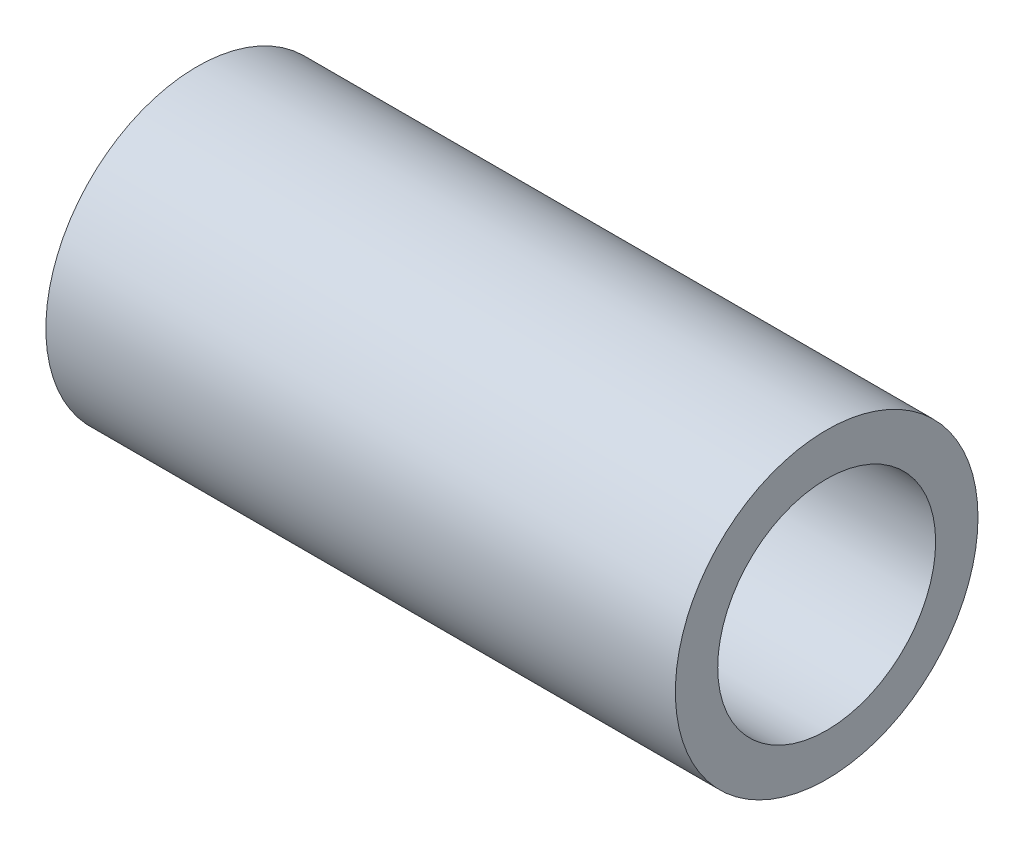
ISO-10303-21;
HEADER;
FILE_DESCRIPTION(('STEP AP214'),'2;1');
FILE_NAME('part.step','',(''),(''),'','','');
FILE_SCHEMA(('AUTOMOTIVE_DESIGN { 1 0 10303 214 1 1 1 1 }'));
ENDSEC;
DATA;
#1=APPLICATION_CONTEXT('core data for automotive mechanical design processes');
#2=APPLICATION_PROTOCOL_DEFINITION('international standard','automotive_design',2000,#1);
#3=PRODUCT_CONTEXT('',#1,'mechanical');
#4=PRODUCT('Part','Part','',(#3));
#5=PRODUCT_RELATED_PRODUCT_CATEGORY('part','',(#4));
#6=PRODUCT_DEFINITION_FORMATION('','',#4);
#7=PRODUCT_DEFINITION_CONTEXT('part definition',#1,'design');
#8=PRODUCT_DEFINITION('design','',#6,#7);
#9=PRODUCT_DEFINITION_SHAPE('','',#8);
#10=(LENGTH_UNIT() NAMED_UNIT(*) SI_UNIT(.MILLI.,.METRE.));
#11=(NAMED_UNIT(*) PLANE_ANGLE_UNIT() SI_UNIT($,.RADIAN.));
#12=(NAMED_UNIT(*) SI_UNIT($,.STERADIAN.) SOLID_ANGLE_UNIT());
#13=UNCERTAINTY_MEASURE_WITH_UNIT(LENGTH_MEASURE(1.E-05),#10,'distance_accuracy_value','');
#14=(GEOMETRIC_REPRESENTATION_CONTEXT(3) GLOBAL_UNCERTAINTY_ASSIGNED_CONTEXT((#13)) GLOBAL_UNIT_ASSIGNED_CONTEXT((#10,
#11,#12)) REPRESENTATION_CONTEXT('',''));
#15=CARTESIAN_POINT('',(0.,0.,0.));
#16=DIRECTION('',(0.,0.,1.));
#17=DIRECTION('',(1.,0.,0.));
#18=AXIS2_PLACEMENT_3D('',#15,#16,#17);
#19=CARTESIAN_POINT('',(26.,0.,0.));
#20=DIRECTION('',(1.,0.,0.));
#21=DIRECTION('',(0.,0.,-1.));
#22=AXIS2_PLACEMENT_3D('',#19,#20,#21);
#23=PLANE('',#22);
#24=CARTESIAN_POINT('',(26.,0.,0.));
#25=DIRECTION('',(1.,0.,0.));
#26=DIRECTION('',(0.,0.,-1.));
#27=AXIS2_PLACEMENT_3D('',#24,#25,#26);
#28=CIRCLE('',#27,12.5);
#29=CARTESIAN_POINT('',(26.,0.,-12.5));
#30=VERTEX_POINT('',#29);
#31=EDGE_CURVE('E11',#30,#30,#28,.T.);
#32=ORIENTED_EDGE('',*,*,#31,.T.);
#33=EDGE_LOOP('',(#32));
#34=FACE_BOUND('',#33,.T.);
#35=CARTESIAN_POINT('',(26.,0.,0.));
#36=DIRECTION('',(1.,0.,0.));
#37=DIRECTION('',(0.,0.,-1.));
#38=AXIS2_PLACEMENT_3D('',#35,#36,#37);
#39=CIRCLE('',#38,9.);
#40=CARTESIAN_POINT('',(26.,0.,-9.));
#41=VERTEX_POINT('',#40);
#42=EDGE_CURVE('E60',#41,#41,#39,.T.);
#43=ORIENTED_EDGE('',*,*,#42,.F.);
#44=EDGE_LOOP('',(#43));
#45=FACE_BOUND('',#44,.T.);
#46=ADVANCED_FACE('F47',(#34,#45),#23,.T.);
#47=CARTESIAN_POINT('',(-26.,0.,0.));
#48=DIRECTION('',(1.,0.,0.));
#49=DIRECTION('',(0.,0.,-1.));
#50=AXIS2_PLACEMENT_3D('',#47,#48,#49);
#51=PLANE('',#50);
#52=CARTESIAN_POINT('',(-26.,0.,0.));
#53=DIRECTION('',(1.,0.,0.));
#54=DIRECTION('',(0.,0.,-1.));
#55=AXIS2_PLACEMENT_3D('',#52,#53,#54);
#56=CIRCLE('',#55,12.5);
#57=CARTESIAN_POINT('',(-26.,0.,-12.5));
#58=VERTEX_POINT('',#57);
#59=EDGE_CURVE('E51',#58,#58,#56,.T.);
#60=ORIENTED_EDGE('',*,*,#59,.F.);
#61=EDGE_LOOP('',(#60));
#62=FACE_BOUND('',#61,.T.);
#63=CARTESIAN_POINT('',(-26.,0.,0.));
#64=DIRECTION('',(1.,0.,0.));
#65=DIRECTION('',(0.,0.,-1.));
#66=AXIS2_PLACEMENT_3D('',#63,#64,#65);
#67=CIRCLE('',#66,9.);
#68=CARTESIAN_POINT('',(-26.,0.,-9.));
#69=VERTEX_POINT('',#68);
#70=EDGE_CURVE('E62',#69,#69,#67,.T.);
#71=ORIENTED_EDGE('',*,*,#70,.T.);
#72=EDGE_LOOP('',(#71));
#73=FACE_BOUND('',#72,.T.);
#74=ADVANCED_FACE('F74',(#62,#73),#51,.F.);
#75=CARTESIAN_POINT('',(26.,0.,0.));
#76=DIRECTION('',(-1.,0.,0.));
#77=DIRECTION('',(0.,0.,1.));
#78=AXIS2_PLACEMENT_3D('',#75,#76,#77);
#79=CYLINDRICAL_SURFACE('',#78,12.5);
#80=ORIENTED_EDGE('',*,*,#31,.F.);
#81=EDGE_LOOP('',(#80));
#82=FACE_BOUND('',#81,.T.);
#83=ORIENTED_EDGE('',*,*,#59,.T.);
#84=EDGE_LOOP('',(#83));
#85=FACE_BOUND('',#84,.T.);
#86=ADVANCED_FACE('F49',(#82,#85),#79,.T.);
#87=CARTESIAN_POINT('',(26.,0.,0.));
#88=DIRECTION('',(-1.,0.,0.));
#89=DIRECTION('',(0.,0.,1.));
#90=AXIS2_PLACEMENT_3D('',#87,#88,#89);
#91=CYLINDRICAL_SURFACE('',#90,9.);
#92=ORIENTED_EDGE('',*,*,#42,.T.);
#93=EDGE_LOOP('',(#92));
#94=FACE_BOUND('',#93,.T.);
#95=ORIENTED_EDGE('',*,*,#70,.F.);
#96=EDGE_LOOP('',(#95));
#97=FACE_BOUND('',#96,.T.);
#98=ADVANCED_FACE('F70',(#94,#97),#91,.F.);
#99=CLOSED_SHELL('',(#46,#74,#86,#98));
#100=MANIFOLD_SOLID_BREP('B2',#99);
#101=ADVANCED_BREP_SHAPE_REPRESENTATION('',(#18,#100),#14);
#102=SHAPE_DEFINITION_REPRESENTATION(#9,#101);
ENDSEC;
END-ISO-10303-21;
